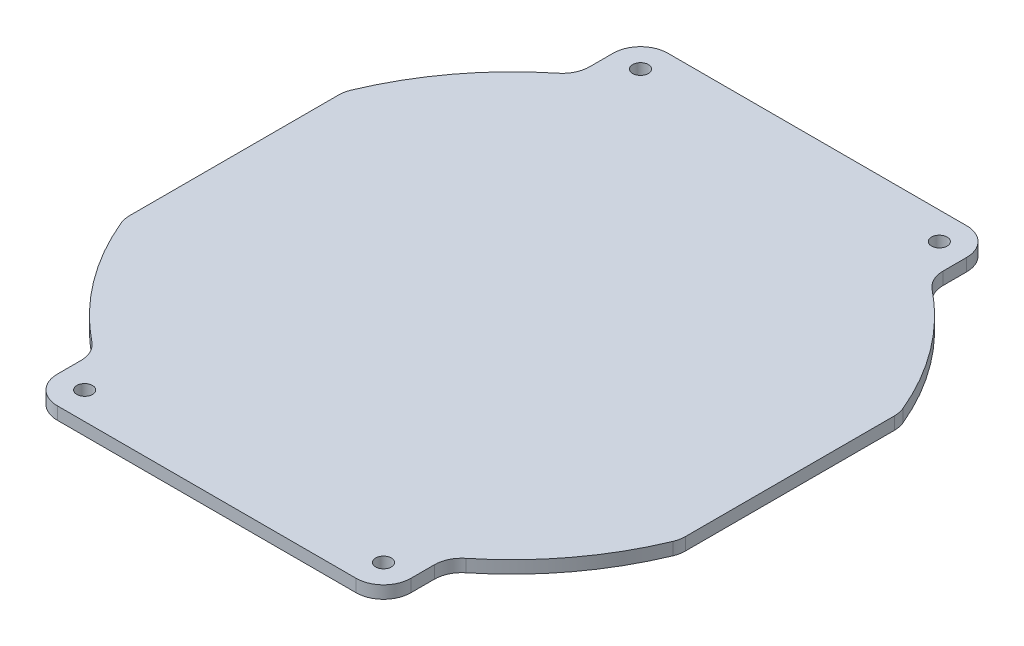
ISO-10303-21;
HEADER;
FILE_DESCRIPTION(('STEP AP214'),'2;1');
FILE_NAME('part.step','',(''),(''),'','','');
FILE_SCHEMA(('AUTOMOTIVE_DESIGN { 1 0 10303 214 1 1 1 1 }'));
ENDSEC;
DATA;
#1=APPLICATION_CONTEXT('core data for automotive mechanical design processes');
#2=APPLICATION_PROTOCOL_DEFINITION('international standard','automotive_design',2000,#1);
#3=PRODUCT_CONTEXT('',#1,'mechanical');
#4=PRODUCT('Part','Part','',(#3));
#5=PRODUCT_RELATED_PRODUCT_CATEGORY('part','',(#4));
#6=PRODUCT_DEFINITION_FORMATION('','',#4);
#7=PRODUCT_DEFINITION_CONTEXT('part definition',#1,'design');
#8=PRODUCT_DEFINITION('design','',#6,#7);
#9=PRODUCT_DEFINITION_SHAPE('','',#8);
#10=(LENGTH_UNIT() NAMED_UNIT(*) SI_UNIT(.MILLI.,.METRE.));
#11=(NAMED_UNIT(*) PLANE_ANGLE_UNIT() SI_UNIT($,.RADIAN.));
#12=(NAMED_UNIT(*) SI_UNIT($,.STERADIAN.) SOLID_ANGLE_UNIT());
#13=UNCERTAINTY_MEASURE_WITH_UNIT(LENGTH_MEASURE(1.E-05),#10,'distance_accuracy_value','');
#14=(GEOMETRIC_REPRESENTATION_CONTEXT(3) GLOBAL_UNCERTAINTY_ASSIGNED_CONTEXT((#13)) GLOBAL_UNIT_ASSIGNED_CONTEXT((#10,
#11,#12)) REPRESENTATION_CONTEXT('',''));
#15=CARTESIAN_POINT('',(0.,0.,0.));
#16=DIRECTION('',(0.,0.,1.));
#17=DIRECTION('',(1.,0.,0.));
#18=AXIS2_PLACEMENT_3D('',#15,#16,#17);
#19=CARTESIAN_POINT('',(22.5425,-19.99,10.614330550506));
#20=DIRECTION('',(-1.,0.,0.));
#21=DIRECTION('',(0.,0.,1.));
#22=AXIS2_PLACEMENT_3D('',#19,#20,#21);
#23=PLANE('',#22);
#24=DIRECTION('',(0.,0.,-1.));
#25=VECTOR('',#24,1.);
#26=CARTESIAN_POINT('',(22.5425,-21.59,10.614330550506));
#27=LINE('',#26,#25);
#28=CARTESIAN_POINT('',(22.5425,-21.59,11.2267999999997));
#29=VERTEX_POINT('',#28);
#30=CARTESIAN_POINT('',(22.5425,-21.59,8.23011963170299));
#31=VERTEX_POINT('',#30);
#32=EDGE_CURVE('E11',#29,#31,#27,.T.);
#33=ORIENTED_EDGE('',*,*,#32,.T.);
#34=DIRECTION('',(0.,1.,0.));
#35=VECTOR('',#34,1.);
#36=CARTESIAN_POINT('',(22.5425,-19.99,8.23011963170299));
#37=LINE('',#36,#35);
#38=CARTESIAN_POINT('',(22.5425,-19.99,8.23011963170299));
#39=VERTEX_POINT('',#38);
#40=EDGE_CURVE('E52',#31,#39,#37,.T.);
#41=ORIENTED_EDGE('',*,*,#40,.T.);
#42=DIRECTION('',(0.,0.,-1.));
#43=VECTOR('',#42,1.);
#44=CARTESIAN_POINT('',(22.5425,-19.99,10.614330550506));
#45=LINE('',#44,#43);
#46=CARTESIAN_POINT('',(22.5425,-19.99,11.2267999999997));
#47=VERTEX_POINT('',#46);
#48=EDGE_CURVE('E358',#47,#39,#45,.T.);
#49=ORIENTED_EDGE('',*,*,#48,.F.);
#50=DIRECTION('',(0.,-1.,0.));
#51=VECTOR('',#50,1.);
#52=CARTESIAN_POINT('',(22.5425,-19.99,11.2267999999997));
#53=LINE('',#52,#51);
#54=EDGE_CURVE('E228',#47,#29,#53,.T.);
#55=ORIENTED_EDGE('',*,*,#54,.T.);
#56=EDGE_LOOP('',(#33,#41,#49,#55));
#57=FACE_BOUND('',#56,.T.);
#58=ADVANCED_FACE('F45',(#57),#23,.F.);
#59=CARTESIAN_POINT('',(0.,-19.99,-24.2062));
#60=DIRECTION('',(0.,-1.,0.));
#61=DIRECTION('',(0.,0.,-1.));
#62=AXIS2_PLACEMENT_3D('',#59,#60,#61);
#63=CYLINDRICAL_SURFACE('',#62,38.1);
#64=CARTESIAN_POINT('',(0.,-21.59,-24.2062));
#65=DIRECTION('',(0.,1.,0.));
#66=DIRECTION('',(0.,0.,1.));
#67=AXIS2_PLACEMENT_3D('',#64,#65,#66);
#68=CIRCLE('',#67,38.1);
#69=CARTESIAN_POINT('',(23.848854961832,-21.59,5.50645920461343));
#70=VERTEX_POINT('',#69);
#71=CARTESIAN_POINT('',(35.1638532110092,-21.59,-9.53945437069972));
#72=VERTEX_POINT('',#71);
#73=EDGE_CURVE('E355',#70,#72,#68,.T.);
#74=ORIENTED_EDGE('',*,*,#73,.T.);
#75=DIRECTION('',(0.,-1.,0.));
#76=VECTOR('',#75,1.);
#77=CARTESIAN_POINT('',(35.1638532110092,-19.99,-9.53945437069972));
#78=LINE('',#77,#76);
#79=CARTESIAN_POINT('',(35.1638532110092,-19.99,-9.53945437069972));
#80=VERTEX_POINT('',#79);
#81=EDGE_CURVE('E353',#72,#80,#78,.F.);
#82=ORIENTED_EDGE('',*,*,#81,.T.);
#83=CARTESIAN_POINT('',(0.,-19.99,-24.2062));
#84=DIRECTION('',(0.,1.,0.));
#85=DIRECTION('',(0.,0.,1.));
#86=AXIS2_PLACEMENT_3D('',#83,#84,#85);
#87=CIRCLE('',#86,38.1);
#88=CARTESIAN_POINT('',(23.848854961832,-19.99,5.50645920461343));
#89=VERTEX_POINT('',#88);
#90=EDGE_CURVE('E350',#89,#80,#87,.T.);
#91=ORIENTED_EDGE('',*,*,#90,.F.);
#92=DIRECTION('',(0.,-1.,0.));
#93=VECTOR('',#92,1.);
#94=CARTESIAN_POINT('',(23.848854961832,-19.99,5.50645920461343));
#95=LINE('',#94,#93);
#96=EDGE_CURVE('E348',#89,#70,#95,.T.);
#97=ORIENTED_EDGE('',*,*,#96,.T.);
#98=EDGE_LOOP('',(#74,#82,#91,#97));
#99=FACE_BOUND('',#98,.T.);
#100=ADVANCED_FACE('F367',(#99),#63,.T.);
#101=CARTESIAN_POINT('',(35.433,-19.99,-24.2062));
#102=DIRECTION('',(-1.,0.,0.));
#103=DIRECTION('',(0.,0.,1.));
#104=AXIS2_PLACEMENT_3D('',#101,#102,#103);
#105=PLANE('',#104);
#106=DIRECTION('',(0.,0.,-1.));
#107=VECTOR('',#106,1.);
#108=CARTESIAN_POINT('',(35.433,-21.59,-24.2062));
#109=LINE('',#108,#107);
#110=CARTESIAN_POINT('',(35.433,-21.59,-10.8839060533856));
#111=VERTEX_POINT('',#110);
#112=CARTESIAN_POINT('',(35.433,-21.59,-37.5284939466144));
#113=VERTEX_POINT('',#112);
#114=EDGE_CURVE('E346',#111,#113,#109,.T.);
#115=ORIENTED_EDGE('',*,*,#114,.T.);
#116=DIRECTION('',(0.,-1.,0.));
#117=VECTOR('',#116,1.);
#118=CARTESIAN_POINT('',(35.433,-19.99,-37.5284939466144));
#119=LINE('',#118,#117);
#120=CARTESIAN_POINT('',(35.433,-19.99,-37.5284939466144));
#121=VERTEX_POINT('',#120);
#122=EDGE_CURVE('E344',#113,#121,#119,.F.);
#123=ORIENTED_EDGE('',*,*,#122,.T.);
#124=DIRECTION('',(0.,0.,-1.));
#125=VECTOR('',#124,1.);
#126=CARTESIAN_POINT('',(35.433,-19.99,-24.2062));
#127=LINE('',#126,#125);
#128=CARTESIAN_POINT('',(35.433,-19.99,-10.8839060533856));
#129=VERTEX_POINT('',#128);
#130=EDGE_CURVE('E341',#129,#121,#127,.T.);
#131=ORIENTED_EDGE('',*,*,#130,.F.);
#132=DIRECTION('',(0.,-1.,0.));
#133=VECTOR('',#132,1.);
#134=CARTESIAN_POINT('',(35.433,-19.99,-10.8839060533856));
#135=LINE('',#134,#133);
#136=EDGE_CURVE('E339',#129,#111,#135,.T.);
#137=ORIENTED_EDGE('',*,*,#136,.T.);
#138=EDGE_LOOP('',(#115,#123,#131,#137));
#139=FACE_BOUND('',#138,.T.);
#140=ADVANCED_FACE('F389',(#139),#105,.F.);
#141=CARTESIAN_POINT('',(0.,-19.99,-24.2062));
#142=DIRECTION('',(0.,-1.,0.));
#143=DIRECTION('',(0.,0.,-1.));
#144=AXIS2_PLACEMENT_3D('',#141,#142,#143);
#145=CYLINDRICAL_SURFACE('',#144,38.1);
#146=CARTESIAN_POINT('',(0.,-21.59,-24.2062));
#147=DIRECTION('',(0.,1.,0.));
#148=DIRECTION('',(0.,0.,1.));
#149=AXIS2_PLACEMENT_3D('',#146,#147,#148);
#150=CIRCLE('',#149,38.1);
#151=CARTESIAN_POINT('',(35.1638532110092,-21.59,-38.8729456293002));
#152=VERTEX_POINT('',#151);
#153=CARTESIAN_POINT('',(23.848854961832,-21.59,-53.9188592046134));
#154=VERTEX_POINT('',#153);
#155=EDGE_CURVE('E337',#152,#154,#150,.T.);
#156=ORIENTED_EDGE('',*,*,#155,.T.);
#157=DIRECTION('',(0.,-1.,0.));
#158=VECTOR('',#157,1.);
#159=CARTESIAN_POINT('',(23.848854961832,-19.99,-53.9188592046134));
#160=LINE('',#159,#158);
#161=CARTESIAN_POINT('',(23.848854961832,-19.99,-53.9188592046134));
#162=VERTEX_POINT('',#161);
#163=EDGE_CURVE('E335',#154,#162,#160,.F.);
#164=ORIENTED_EDGE('',*,*,#163,.T.);
#165=CARTESIAN_POINT('',(0.,-19.99,-24.2062));
#166=DIRECTION('',(0.,1.,0.));
#167=DIRECTION('',(0.,0.,1.));
#168=AXIS2_PLACEMENT_3D('',#165,#166,#167);
#169=CIRCLE('',#168,38.1);
#170=CARTESIAN_POINT('',(35.1638532110092,-19.99,-38.8729456293002));
#171=VERTEX_POINT('',#170);
#172=EDGE_CURVE('E332',#171,#162,#169,.T.);
#173=ORIENTED_EDGE('',*,*,#172,.F.);
#174=DIRECTION('',(0.,-1.,0.));
#175=VECTOR('',#174,1.);
#176=CARTESIAN_POINT('',(35.1638532110092,-19.99,-38.8729456293002));
#177=LINE('',#176,#175);
#178=EDGE_CURVE('E330',#171,#152,#177,.T.);
#179=ORIENTED_EDGE('',*,*,#178,.T.);
#180=EDGE_LOOP('',(#156,#164,#173,#179));
#181=FACE_BOUND('',#180,.T.);
#182=ADVANCED_FACE('F497',(#181),#145,.T.);
#183=CARTESIAN_POINT('',(22.5425,-19.99,-59.026730550506));
#184=DIRECTION('',(1.,0.,0.));
#185=DIRECTION('',(0.,0.,-1.));
#186=AXIS2_PLACEMENT_3D('',#183,#184,#185);
#187=PLANE('',#186);
#188=DIRECTION('',(0.,0.,1.));
#189=VECTOR('',#188,1.);
#190=CARTESIAN_POINT('',(22.5425,-19.99,-59.026730550506));
#191=LINE('',#190,#189);
#192=CARTESIAN_POINT('',(22.5425,-19.99,-59.6392));
#193=VERTEX_POINT('',#192);
#194=CARTESIAN_POINT('',(22.5425,-19.99,-56.642519631703));
#195=VERTEX_POINT('',#194);
#196=EDGE_CURVE('E328',#193,#195,#191,.T.);
#197=ORIENTED_EDGE('',*,*,#196,.T.);
#198=DIRECTION('',(0.,-1.,0.));
#199=VECTOR('',#198,1.);
#200=CARTESIAN_POINT('',(22.5425,-19.99,-56.642519631703));
#201=LINE('',#200,#199);
#202=CARTESIAN_POINT('',(22.5425,-21.59,-56.642519631703));
#203=VERTEX_POINT('',#202);
#204=EDGE_CURVE('E326',#195,#203,#201,.T.);
#205=ORIENTED_EDGE('',*,*,#204,.T.);
#206=DIRECTION('',(0.,0.,1.));
#207=VECTOR('',#206,1.);
#208=CARTESIAN_POINT('',(22.5425,-21.59,-59.026730550506));
#209=LINE('',#208,#207);
#210=CARTESIAN_POINT('',(22.5425,-21.59,-59.6392));
#211=VERTEX_POINT('',#210);
#212=EDGE_CURVE('E323',#211,#203,#209,.T.);
#213=ORIENTED_EDGE('',*,*,#212,.F.);
#214=DIRECTION('',(0.,-1.,0.));
#215=VECTOR('',#214,1.);
#216=CARTESIAN_POINT('',(22.5425,-19.99,-59.6392));
#217=LINE('',#216,#215);
#218=EDGE_CURVE('E321',#211,#193,#217,.F.);
#219=ORIENTED_EDGE('',*,*,#218,.T.);
#220=EDGE_LOOP('',(#197,#205,#213,#219));
#221=FACE_BOUND('',#220,.T.);
#222=ADVANCED_FACE('F487',(#221),#187,.T.);
#223=CARTESIAN_POINT('',(0.,-19.99,-63.1317));
#224=DIRECTION('',(0.,0.,-1.));
#225=DIRECTION('',(-1.,0.,0.));
#226=AXIS2_PLACEMENT_3D('',#223,#224,#225);
#227=PLANE('',#226);
#228=DIRECTION('',(1.,0.,0.));
#229=VECTOR('',#228,1.);
#230=CARTESIAN_POINT('',(0.,-19.99,-63.1317));
#231=LINE('',#230,#229);
#232=CARTESIAN_POINT('',(-19.05,-19.99,-63.1317));
#233=VERTEX_POINT('',#232);
#234=CARTESIAN_POINT('',(19.05,-19.99,-63.1317));
#235=VERTEX_POINT('',#234);
#236=EDGE_CURVE('E319',#233,#235,#231,.T.);
#237=ORIENTED_EDGE('',*,*,#236,.T.);
#238=DIRECTION('',(0.,-1.,0.));
#239=VECTOR('',#238,1.);
#240=CARTESIAN_POINT('',(19.05,-19.99,-63.1317));
#241=LINE('',#240,#239);
#242=CARTESIAN_POINT('',(19.05,-21.59,-63.1317));
#243=VERTEX_POINT('',#242);
#244=EDGE_CURVE('E317',#235,#243,#241,.T.);
#245=ORIENTED_EDGE('',*,*,#244,.T.);
#246=DIRECTION('',(1.,0.,0.));
#247=VECTOR('',#246,1.);
#248=CARTESIAN_POINT('',(0.,-21.59,-63.1317));
#249=LINE('',#248,#247);
#250=CARTESIAN_POINT('',(-19.05,-21.59,-63.1317));
#251=VERTEX_POINT('',#250);
#252=EDGE_CURVE('E314',#251,#243,#249,.T.);
#253=ORIENTED_EDGE('',*,*,#252,.F.);
#254=DIRECTION('',(0.,-1.,0.));
#255=VECTOR('',#254,1.);
#256=CARTESIAN_POINT('',(-19.05,-19.99,-63.1317));
#257=LINE('',#256,#255);
#258=EDGE_CURVE('E312',#251,#233,#257,.F.);
#259=ORIENTED_EDGE('',*,*,#258,.T.);
#260=EDGE_LOOP('',(#237,#245,#253,#259));
#261=FACE_BOUND('',#260,.T.);
#262=ADVANCED_FACE('F504',(#261),#227,.T.);
#263=CARTESIAN_POINT('',(-22.5425,-19.99,-59.026730550506));
#264=DIRECTION('',(1.,0.,0.));
#265=DIRECTION('',(0.,0.,-1.));
#266=AXIS2_PLACEMENT_3D('',#263,#264,#265);
#267=PLANE('',#266);
#268=DIRECTION('',(0.,0.,1.));
#269=VECTOR('',#268,1.);
#270=CARTESIAN_POINT('',(-22.5425,-21.59,-59.026730550506));
#271=LINE('',#270,#269);
#272=CARTESIAN_POINT('',(-22.5425,-21.59,-59.6392));
#273=VERTEX_POINT('',#272);
#274=CARTESIAN_POINT('',(-22.5425,-21.59,-56.642519631703));
#275=VERTEX_POINT('',#274);
#276=EDGE_CURVE('E310',#273,#275,#271,.T.);
#277=ORIENTED_EDGE('',*,*,#276,.T.);
#278=DIRECTION('',(0.,1.,0.));
#279=VECTOR('',#278,1.);
#280=CARTESIAN_POINT('',(-22.5425,-19.99,-56.642519631703));
#281=LINE('',#280,#279);
#282=CARTESIAN_POINT('',(-22.5425,-19.99,-56.642519631703));
#283=VERTEX_POINT('',#282);
#284=EDGE_CURVE('E308',#275,#283,#281,.T.);
#285=ORIENTED_EDGE('',*,*,#284,.T.);
#286=DIRECTION('',(0.,0.,1.));
#287=VECTOR('',#286,1.);
#288=CARTESIAN_POINT('',(-22.5425,-19.99,-59.026730550506));
#289=LINE('',#288,#287);
#290=CARTESIAN_POINT('',(-22.5425,-19.99,-59.6392));
#291=VERTEX_POINT('',#290);
#292=EDGE_CURVE('E305',#291,#283,#289,.T.);
#293=ORIENTED_EDGE('',*,*,#292,.F.);
#294=DIRECTION('',(0.,-1.,0.));
#295=VECTOR('',#294,1.);
#296=CARTESIAN_POINT('',(-22.5425,-21.59,-59.6392));
#297=LINE('',#296,#295);
#298=EDGE_CURVE('E303',#291,#273,#297,.T.);
#299=ORIENTED_EDGE('',*,*,#298,.T.);
#300=EDGE_LOOP('',(#277,#285,#293,#299));
#301=FACE_BOUND('',#300,.T.);
#302=ADVANCED_FACE('F472',(#301),#267,.F.);
#303=CARTESIAN_POINT('',(1.16226472890446E-13,-19.99,-24.2062));
#304=DIRECTION('',(0.,-1.,0.));
#305=DIRECTION('',(0.,0.,-1.));
#306=AXIS2_PLACEMENT_3D('',#303,#304,#305);
#307=CYLINDRICAL_SURFACE('',#306,38.1);
#308=CARTESIAN_POINT('',(1.16226472890446E-13,-21.59,-24.2062));
#309=DIRECTION('',(0.,1.,0.));
#310=DIRECTION('',(0.,0.,1.));
#311=AXIS2_PLACEMENT_3D('',#308,#309,#310);
#312=CIRCLE('',#311,38.1);
#313=CARTESIAN_POINT('',(-23.848854961832,-21.59,-53.9188592046134));
#314=VERTEX_POINT('',#313);
#315=CARTESIAN_POINT('',(-35.1638532110092,-21.59,-38.8729456293002));
#316=VERTEX_POINT('',#315);
#317=EDGE_CURVE('E301',#314,#316,#312,.T.);
#318=ORIENTED_EDGE('',*,*,#317,.T.);
#319=DIRECTION('',(0.,-1.,0.));
#320=VECTOR('',#319,1.);
#321=CARTESIAN_POINT('',(-35.1638532110092,-19.99,-38.8729456293002));
#322=LINE('',#321,#320);
#323=CARTESIAN_POINT('',(-35.1638532110092,-19.99,-38.8729456293002));
#324=VERTEX_POINT('',#323);
#325=EDGE_CURVE('E299',#316,#324,#322,.F.);
#326=ORIENTED_EDGE('',*,*,#325,.T.);
#327=CARTESIAN_POINT('',(1.16226472890446E-13,-19.99,-24.2062));
#328=DIRECTION('',(0.,1.,0.));
#329=DIRECTION('',(0.,0.,1.));
#330=AXIS2_PLACEMENT_3D('',#327,#328,#329);
#331=CIRCLE('',#330,38.1);
#332=CARTESIAN_POINT('',(-23.848854961832,-19.99,-53.9188592046134));
#333=VERTEX_POINT('',#332);
#334=EDGE_CURVE('E296',#333,#324,#331,.T.);
#335=ORIENTED_EDGE('',*,*,#334,.F.);
#336=DIRECTION('',(0.,-1.,0.));
#337=VECTOR('',#336,1.);
#338=CARTESIAN_POINT('',(-23.848854961832,-19.99,-53.9188592046134));
#339=LINE('',#338,#337);
#340=EDGE_CURVE('E294',#333,#314,#339,.T.);
#341=ORIENTED_EDGE('',*,*,#340,.T.);
#342=EDGE_LOOP('',(#318,#326,#335,#341));
#343=FACE_BOUND('',#342,.T.);
#344=ADVANCED_FACE('F462',(#343),#307,.T.);
#345=CARTESIAN_POINT('',(-35.433,-19.99,-24.2062));
#346=DIRECTION('',(-1.,0.,0.));
#347=DIRECTION('',(0.,0.,1.));
#348=AXIS2_PLACEMENT_3D('',#345,#346,#347);
#349=PLANE('',#348);
#350=DIRECTION('',(0.,0.,-1.));
#351=VECTOR('',#350,1.);
#352=CARTESIAN_POINT('',(-35.433,-21.59,-24.2062));
#353=LINE('',#352,#351);
#354=CARTESIAN_POINT('',(-35.433,-21.59,-10.8839060533855));
#355=VERTEX_POINT('',#354);
#356=CARTESIAN_POINT('',(-35.433,-21.59,-37.5284939466144));
#357=VERTEX_POINT('',#356);
#358=EDGE_CURVE('E291',#355,#357,#353,.T.);
#359=ORIENTED_EDGE('',*,*,#358,.F.);
#360=DIRECTION('',(0.,1.,0.));
#361=VECTOR('',#360,1.);
#362=CARTESIAN_POINT('',(-35.433,-19.99,-10.8839060533855));
#363=LINE('',#362,#361);
#364=CARTESIAN_POINT('',(-35.433,-19.99,-10.8839060533855));
#365=VERTEX_POINT('',#364);
#366=EDGE_CURVE('E289',#355,#365,#363,.T.);
#367=ORIENTED_EDGE('',*,*,#366,.T.);
#368=DIRECTION('',(0.,0.,-1.));
#369=VECTOR('',#368,1.);
#370=CARTESIAN_POINT('',(-35.433,-19.99,-24.2062));
#371=LINE('',#370,#369);
#372=CARTESIAN_POINT('',(-35.433,-19.99,-37.5284939466144));
#373=VERTEX_POINT('',#372);
#374=EDGE_CURVE('E287',#365,#373,#371,.T.);
#375=ORIENTED_EDGE('',*,*,#374,.T.);
#376=DIRECTION('',(0.,1.,0.));
#377=VECTOR('',#376,1.);
#378=CARTESIAN_POINT('',(-35.433,-21.59,-37.5284939466144));
#379=LINE('',#378,#377);
#380=EDGE_CURVE('E285',#373,#357,#379,.F.);
#381=ORIENTED_EDGE('',*,*,#380,.T.);
#382=EDGE_LOOP('',(#359,#367,#375,#381));
#383=FACE_BOUND('',#382,.T.);
#384=ADVANCED_FACE('F559',(#383),#349,.T.);
#385=CARTESIAN_POINT('',(0.,-19.99,-24.2062));
#386=DIRECTION('',(0.,-1.,0.));
#387=DIRECTION('',(0.,0.,-1.));
#388=AXIS2_PLACEMENT_3D('',#385,#386,#387);
#389=CYLINDRICAL_SURFACE('',#388,38.1);
#390=CARTESIAN_POINT('',(0.,-19.99,-24.2062));
#391=DIRECTION('',(0.,1.,0.));
#392=DIRECTION('',(0.,0.,1.));
#393=AXIS2_PLACEMENT_3D('',#390,#391,#392);
#394=CIRCLE('',#393,38.1);
#395=CARTESIAN_POINT('',(-35.1638532110092,-19.99,-9.53945437069966));
#396=VERTEX_POINT('',#395);
#397=CARTESIAN_POINT('',(-23.848854961832,-19.99,5.50645920461343));
#398=VERTEX_POINT('',#397);
#399=EDGE_CURVE('E282',#396,#398,#394,.T.);
#400=ORIENTED_EDGE('',*,*,#399,.F.);
#401=DIRECTION('',(0.,-1.,0.));
#402=VECTOR('',#401,1.);
#403=CARTESIAN_POINT('',(-35.1638532110092,-19.99,-9.53945437069966));
#404=LINE('',#403,#402);
#405=CARTESIAN_POINT('',(-35.1638532110092,-21.59,-9.53945437069966));
#406=VERTEX_POINT('',#405);
#407=EDGE_CURVE('E280',#396,#406,#404,.T.);
#408=ORIENTED_EDGE('',*,*,#407,.T.);
#409=CARTESIAN_POINT('',(0.,-21.59,-24.2062));
#410=DIRECTION('',(0.,1.,0.));
#411=DIRECTION('',(0.,0.,1.));
#412=AXIS2_PLACEMENT_3D('',#409,#410,#411);
#413=CIRCLE('',#412,38.1);
#414=CARTESIAN_POINT('',(-23.848854961832,-21.59,5.50645920461343));
#415=VERTEX_POINT('',#414);
#416=EDGE_CURVE('E278',#406,#415,#413,.T.);
#417=ORIENTED_EDGE('',*,*,#416,.T.);
#418=DIRECTION('',(0.,-1.,0.));
#419=VECTOR('',#418,1.);
#420=CARTESIAN_POINT('',(-23.848854961832,-19.99,5.50645920461343));
#421=LINE('',#420,#419);
#422=EDGE_CURVE('E276',#415,#398,#421,.F.);
#423=ORIENTED_EDGE('',*,*,#422,.T.);
#424=EDGE_LOOP('',(#400,#408,#417,#423));
#425=FACE_BOUND('',#424,.T.);
#426=ADVANCED_FACE('F447',(#425),#389,.T.);
#427=CARTESIAN_POINT('',(-22.5425,-19.99,10.614330550506));
#428=DIRECTION('',(-1.,0.,0.));
#429=DIRECTION('',(0.,0.,1.));
#430=AXIS2_PLACEMENT_3D('',#427,#428,#429);
#431=PLANE('',#430);
#432=DIRECTION('',(0.,0.,-1.));
#433=VECTOR('',#432,1.);
#434=CARTESIAN_POINT('',(-22.5425,-19.99,10.614330550506));
#435=LINE('',#434,#433);
#436=CARTESIAN_POINT('',(-22.5425,-19.99,11.2267999999997));
#437=VERTEX_POINT('',#436);
#438=CARTESIAN_POINT('',(-22.5425,-19.99,8.230119631703));
#439=VERTEX_POINT('',#438);
#440=EDGE_CURVE('E274',#437,#439,#435,.T.);
#441=ORIENTED_EDGE('',*,*,#440,.T.);
#442=DIRECTION('',(0.,-1.,0.));
#443=VECTOR('',#442,1.);
#444=CARTESIAN_POINT('',(-22.5425,-19.99,8.230119631703));
#445=LINE('',#444,#443);
#446=CARTESIAN_POINT('',(-22.5425,-21.59,8.230119631703));
#447=VERTEX_POINT('',#446);
#448=EDGE_CURVE('E272',#439,#447,#445,.T.);
#449=ORIENTED_EDGE('',*,*,#448,.T.);
#450=DIRECTION('',(0.,0.,-1.));
#451=VECTOR('',#450,1.);
#452=CARTESIAN_POINT('',(-22.5425,-21.59,10.614330550506));
#453=LINE('',#452,#451);
#454=CARTESIAN_POINT('',(-22.5425,-21.59,11.2267999999997));
#455=VERTEX_POINT('',#454);
#456=EDGE_CURVE('E269',#455,#447,#453,.T.);
#457=ORIENTED_EDGE('',*,*,#456,.F.);
#458=DIRECTION('',(0.,-1.,0.));
#459=VECTOR('',#458,1.);
#460=CARTESIAN_POINT('',(-22.5425,-19.99,11.2267999999997));
#461=LINE('',#460,#459);
#462=EDGE_CURVE('E267',#455,#437,#461,.F.);
#463=ORIENTED_EDGE('',*,*,#462,.T.);
#464=EDGE_LOOP('',(#441,#449,#457,#463));
#465=FACE_BOUND('',#464,.T.);
#466=ADVANCED_FACE('F578',(#465),#431,.T.);
#467=CARTESIAN_POINT('',(-19.05,-19.99,11.2268));
#468=DIRECTION('',(0.,-1.,0.));
#469=DIRECTION('',(0.,0.,-1.));
#470=AXIS2_PLACEMENT_3D('',#467,#468,#469);
#471=CYLINDRICAL_SURFACE('',#470,1.);
#472=CARTESIAN_POINT('',(-19.05,-19.99,11.2268));
#473=DIRECTION('',(0.,1.,0.));
#474=DIRECTION('',(0.,0.,1.));
#475=AXIS2_PLACEMENT_3D('',#472,#473,#474);
#476=CIRCLE('',#475,1.);
#477=CARTESIAN_POINT('',(-19.05,-19.99,12.2268));
#478=VERTEX_POINT('',#477);
#479=EDGE_CURVE('E264',#478,#478,#476,.T.);
#480=ORIENTED_EDGE('',*,*,#479,.T.);
#481=EDGE_LOOP('',(#480));
#482=FACE_BOUND('',#481,.T.);
#483=CARTESIAN_POINT('',(-19.05,-21.59,11.2268));
#484=DIRECTION('',(0.,1.,0.));
#485=DIRECTION('',(0.,0.,1.));
#486=AXIS2_PLACEMENT_3D('',#483,#484,#485);
#487=CIRCLE('',#486,1.);
#488=CARTESIAN_POINT('',(-19.05,-21.59,12.2268));
#489=VERTEX_POINT('',#488);
#490=EDGE_CURVE('E261',#489,#489,#487,.T.);
#491=ORIENTED_EDGE('',*,*,#490,.F.);
#492=EDGE_LOOP('',(#491));
#493=FACE_BOUND('',#492,.T.);
#494=ADVANCED_FACE('F588',(#482,#493),#471,.F.);
#495=CARTESIAN_POINT('',(19.05,-19.99,-59.6392));
#496=DIRECTION('',(0.,-1.,0.));
#497=DIRECTION('',(0.,0.,-1.));
#498=AXIS2_PLACEMENT_3D('',#495,#496,#497);
#499=CYLINDRICAL_SURFACE('',#498,1.);
#500=CARTESIAN_POINT('',(19.05,-19.99,-59.6392));
#501=DIRECTION('',(0.,1.,0.));
#502=DIRECTION('',(0.,0.,1.));
#503=AXIS2_PLACEMENT_3D('',#500,#501,#502);
#504=CIRCLE('',#503,1.);
#505=CARTESIAN_POINT('',(19.05,-19.99,-58.6392));
#506=VERTEX_POINT('',#505);
#507=EDGE_CURVE('E258',#506,#506,#504,.T.);
#508=ORIENTED_EDGE('',*,*,#507,.T.);
#509=EDGE_LOOP('',(#508));
#510=FACE_BOUND('',#509,.T.);
#511=CARTESIAN_POINT('',(19.05,-21.59,-59.6392));
#512=DIRECTION('',(0.,1.,0.));
#513=DIRECTION('',(0.,0.,1.));
#514=AXIS2_PLACEMENT_3D('',#511,#512,#513);
#515=CIRCLE('',#514,1.);
#516=CARTESIAN_POINT('',(19.05,-21.59,-58.6392));
#517=VERTEX_POINT('',#516);
#518=EDGE_CURVE('E255',#517,#517,#515,.T.);
#519=ORIENTED_EDGE('',*,*,#518,.F.);
#520=EDGE_LOOP('',(#519));
#521=FACE_BOUND('',#520,.T.);
#522=ADVANCED_FACE('F599',(#510,#521),#499,.F.);
#523=CARTESIAN_POINT('',(-19.05,-19.99,-59.6392));
#524=DIRECTION('',(0.,-1.,0.));
#525=DIRECTION('',(0.,0.,-1.));
#526=AXIS2_PLACEMENT_3D('',#523,#524,#525);
#527=CYLINDRICAL_SURFACE('',#526,1.);
#528=CARTESIAN_POINT('',(-19.05,-19.99,-59.6392));
#529=DIRECTION('',(0.,1.,0.));
#530=DIRECTION('',(0.,0.,1.));
#531=AXIS2_PLACEMENT_3D('',#528,#529,#530);
#532=CIRCLE('',#531,1.);
#533=CARTESIAN_POINT('',(-19.05,-19.99,-58.6392));
#534=VERTEX_POINT('',#533);
#535=EDGE_CURVE('E252',#534,#534,#532,.T.);
#536=ORIENTED_EDGE('',*,*,#535,.T.);
#537=EDGE_LOOP('',(#536));
#538=FACE_BOUND('',#537,.T.);
#539=CARTESIAN_POINT('',(-19.05,-21.59,-59.6392));
#540=DIRECTION('',(0.,1.,0.));
#541=DIRECTION('',(0.,0.,1.));
#542=AXIS2_PLACEMENT_3D('',#539,#540,#541);
#543=CIRCLE('',#542,1.);
#544=CARTESIAN_POINT('',(-19.05,-21.59,-58.6392));
#545=VERTEX_POINT('',#544);
#546=EDGE_CURVE('E224',#545,#545,#543,.T.);
#547=ORIENTED_EDGE('',*,*,#546,.F.);
#548=EDGE_LOOP('',(#547));
#549=FACE_BOUND('',#548,.T.);
#550=ADVANCED_FACE('F610',(#538,#549),#527,.F.);
#551=CARTESIAN_POINT('',(0.,-19.99,14.7192999999997));
#552=DIRECTION('',(0.,0.,-1.));
#553=DIRECTION('',(-1.,0.,0.));
#554=AXIS2_PLACEMENT_3D('',#551,#552,#553);
#555=PLANE('',#554);
#556=DIRECTION('',(1.,0.,0.));
#557=VECTOR('',#556,1.);
#558=CARTESIAN_POINT('',(0.,-19.99,14.7192999999997));
#559=LINE('',#558,#557);
#560=CARTESIAN_POINT('',(-19.05,-19.99,14.7192999999997));
#561=VERTEX_POINT('',#560);
#562=CARTESIAN_POINT('',(19.05,-19.99,14.7192999999997));
#563=VERTEX_POINT('',#562);
#564=EDGE_CURVE('E203',#561,#563,#559,.T.);
#565=ORIENTED_EDGE('',*,*,#564,.F.);
#566=DIRECTION('',(0.,-1.,0.));
#567=VECTOR('',#566,1.);
#568=CARTESIAN_POINT('',(-19.05,-21.59,14.7192999999997));
#569=LINE('',#568,#567);
#570=CARTESIAN_POINT('',(-19.05,-21.59,14.7192999999997));
#571=VERTEX_POINT('',#570);
#572=EDGE_CURVE('E225',#561,#571,#569,.T.);
#573=ORIENTED_EDGE('',*,*,#572,.T.);
#574=DIRECTION('',(1.,0.,0.));
#575=VECTOR('',#574,1.);
#576=CARTESIAN_POINT('',(0.,-21.59,14.7192999999997));
#577=LINE('',#576,#575);
#578=CARTESIAN_POINT('',(19.05,-21.59,14.7192999999997));
#579=VERTEX_POINT('',#578);
#580=EDGE_CURVE('E206',#571,#579,#577,.T.);
#581=ORIENTED_EDGE('',*,*,#580,.T.);
#582=DIRECTION('',(0.,-1.,0.));
#583=VECTOR('',#582,1.);
#584=CARTESIAN_POINT('',(19.05,-19.99,14.7192999999997));
#585=LINE('',#584,#583);
#586=EDGE_CURVE('E200',#579,#563,#585,.F.);
#587=ORIENTED_EDGE('',*,*,#586,.T.);
#588=EDGE_LOOP('',(#565,#573,#581,#587));
#589=FACE_BOUND('',#588,.T.);
#590=ADVANCED_FACE('F202',(#589),#555,.F.);
#591=CARTESIAN_POINT('',(19.05,-19.99,11.2268));
#592=DIRECTION('',(0.,-1.,0.));
#593=DIRECTION('',(0.,0.,-1.));
#594=AXIS2_PLACEMENT_3D('',#591,#592,#593);
#595=CYLINDRICAL_SURFACE('',#594,1.);
#596=CARTESIAN_POINT('',(19.05,-19.99,11.2268));
#597=DIRECTION('',(0.,1.,0.));
#598=DIRECTION('',(0.,0.,1.));
#599=AXIS2_PLACEMENT_3D('',#596,#597,#598);
#600=CIRCLE('',#599,1.);
#601=CARTESIAN_POINT('',(19.05,-19.99,12.2268));
#602=VERTEX_POINT('',#601);
#603=EDGE_CURVE('E211',#602,#602,#600,.T.);
#604=ORIENTED_EDGE('',*,*,#603,.T.);
#605=EDGE_LOOP('',(#604));
#606=FACE_BOUND('',#605,.T.);
#607=CARTESIAN_POINT('',(19.05,-21.59,11.2268));
#608=DIRECTION('',(0.,1.,0.));
#609=DIRECTION('',(0.,0.,1.));
#610=AXIS2_PLACEMENT_3D('',#607,#608,#609);
#611=CIRCLE('',#610,1.);
#612=CARTESIAN_POINT('',(19.05,-21.59,12.2268));
#613=VERTEX_POINT('',#612);
#614=EDGE_CURVE('E243',#613,#613,#611,.T.);
#615=ORIENTED_EDGE('',*,*,#614,.F.);
#616=EDGE_LOOP('',(#615));
#617=FACE_BOUND('',#616,.T.);
#618=ADVANCED_FACE('F631',(#606,#617),#595,.F.);
#619=CARTESIAN_POINT('',(-1.33349999999999,-19.99,-24.2062));
#620=DIRECTION('',(0.,1.,0.));
#621=DIRECTION('',(-1.,0.,0.));
#622=AXIS2_PLACEMENT_3D('',#619,#620,#621);
#623=PLANE('',#622);
#624=ORIENTED_EDGE('',*,*,#374,.F.);
#625=CARTESIAN_POINT('',(-31.9405,-19.99,-10.8839060533855));
#626=DIRECTION('',(0.,1.,0.));
#627=DIRECTION('',(0.,0.,1.));
#628=AXIS2_PLACEMENT_3D('',#625,#626,#627);
#629=CIRCLE('',#628,3.4925);
#630=EDGE_CURVE('E240',#365,#396,#629,.T.);
#631=ORIENTED_EDGE('',*,*,#630,.T.);
#632=ORIENTED_EDGE('',*,*,#399,.T.);
#633=CARTESIAN_POINT('',(-26.035,-19.99,8.230119631703));
#634=DIRECTION('',(0.,1.,0.));
#635=DIRECTION('',(0.,0.,1.));
#636=AXIS2_PLACEMENT_3D('',#633,#634,#635);
#637=CIRCLE('',#636,3.4925);
#638=EDGE_CURVE('E231',#398,#439,#637,.F.);
#639=ORIENTED_EDGE('',*,*,#638,.T.);
#640=ORIENTED_EDGE('',*,*,#440,.F.);
#641=CARTESIAN_POINT('',(-19.05,-19.99,11.2267999999997));
#642=DIRECTION('',(0.,1.,0.));
#643=DIRECTION('',(0.,0.,1.));
#644=AXIS2_PLACEMENT_3D('',#641,#642,#643);
#645=CIRCLE('',#644,3.4925);
#646=EDGE_CURVE('E222',#437,#561,#645,.T.);
#647=ORIENTED_EDGE('',*,*,#646,.T.);
#648=ORIENTED_EDGE('',*,*,#564,.T.);
#649=CARTESIAN_POINT('',(19.05,-19.99,11.2267999999997));
#650=DIRECTION('',(0.,1.,0.));
#651=DIRECTION('',(0.,0.,1.));
#652=AXIS2_PLACEMENT_3D('',#649,#650,#651);
#653=CIRCLE('',#652,3.4925);
#654=EDGE_CURVE('E218',#563,#47,#653,.T.);
#655=ORIENTED_EDGE('',*,*,#654,.T.);
#656=ORIENTED_EDGE('',*,*,#48,.T.);
#657=CARTESIAN_POINT('',(26.035,-19.99,8.23011963170299));
#658=DIRECTION('',(0.,1.,0.));
#659=DIRECTION('',(0.,0.,1.));
#660=AXIS2_PLACEMENT_3D('',#657,#658,#659);
#661=CIRCLE('',#660,3.4925);
#662=EDGE_CURVE('E229',#39,#89,#661,.F.);
#663=ORIENTED_EDGE('',*,*,#662,.T.);
#664=ORIENTED_EDGE('',*,*,#90,.T.);
#665=CARTESIAN_POINT('',(31.9405,-19.99,-10.8839060533856));
#666=DIRECTION('',(0.,1.,0.));
#667=DIRECTION('',(0.,0.,1.));
#668=AXIS2_PLACEMENT_3D('',#665,#666,#667);
#669=CIRCLE('',#668,3.4925);
#670=EDGE_CURVE('E234',#80,#129,#669,.T.);
#671=ORIENTED_EDGE('',*,*,#670,.T.);
#672=ORIENTED_EDGE('',*,*,#130,.T.);
#673=CARTESIAN_POINT('',(31.9405,-19.99,-37.5284939466144));
#674=DIRECTION('',(0.,1.,0.));
#675=DIRECTION('',(0.,0.,1.));
#676=AXIS2_PLACEMENT_3D('',#673,#674,#675);
#677=CIRCLE('',#676,3.4925);
#678=EDGE_CURVE('E387',#121,#171,#677,.T.);
#679=ORIENTED_EDGE('',*,*,#678,.T.);
#680=ORIENTED_EDGE('',*,*,#172,.T.);
#681=CARTESIAN_POINT('',(26.035,-19.99,-56.642519631703));
#682=DIRECTION('',(0.,1.,0.));
#683=DIRECTION('',(0.,0.,1.));
#684=AXIS2_PLACEMENT_3D('',#681,#682,#683);
#685=CIRCLE('',#684,3.4925);
#686=EDGE_CURVE('E395',#162,#195,#685,.F.);
#687=ORIENTED_EDGE('',*,*,#686,.T.);
#688=ORIENTED_EDGE('',*,*,#196,.F.);
#689=CARTESIAN_POINT('',(19.05,-19.99,-59.6392));
#690=DIRECTION('',(0.,1.,0.));
#691=DIRECTION('',(0.,0.,1.));
#692=AXIS2_PLACEMENT_3D('',#689,#690,#691);
#693=CIRCLE('',#692,3.4925);
#694=EDGE_CURVE('E398',#193,#235,#693,.T.);
#695=ORIENTED_EDGE('',*,*,#694,.T.);
#696=ORIENTED_EDGE('',*,*,#236,.F.);
#697=CARTESIAN_POINT('',(-19.05,-19.99,-59.6392));
#698=DIRECTION('',(0.,1.,0.));
#699=DIRECTION('',(0.,0.,1.));
#700=AXIS2_PLACEMENT_3D('',#697,#698,#699);
#701=CIRCLE('',#700,3.4925);
#702=EDGE_CURVE('E403',#233,#291,#701,.T.);
#703=ORIENTED_EDGE('',*,*,#702,.T.);
#704=ORIENTED_EDGE('',*,*,#292,.T.);
#705=CARTESIAN_POINT('',(-26.035,-19.99,-56.642519631703));
#706=DIRECTION('',(0.,1.,0.));
#707=DIRECTION('',(0.,0.,1.));
#708=AXIS2_PLACEMENT_3D('',#705,#706,#707);
#709=CIRCLE('',#708,3.4925);
#710=EDGE_CURVE('E406',#283,#333,#709,.F.);
#711=ORIENTED_EDGE('',*,*,#710,.T.);
#712=ORIENTED_EDGE('',*,*,#334,.T.);
#713=CARTESIAN_POINT('',(-31.9405,-19.99,-37.5284939466144));
#714=DIRECTION('',(0.,1.,0.));
#715=DIRECTION('',(0.,0.,1.));
#716=AXIS2_PLACEMENT_3D('',#713,#714,#715);
#717=CIRCLE('',#716,3.4925);
#718=EDGE_CURVE('E409',#324,#373,#717,.T.);
#719=ORIENTED_EDGE('',*,*,#718,.T.);
#720=EDGE_LOOP('',(#624,#631,#632,#639,#640,#647,#648,#655,#656,#663,#664,#671,#672,#679,#680,
#687,#688,#695,#696,#703,#704,#711,#712,#719));
#721=FACE_BOUND('',#720,.T.);
#722=ORIENTED_EDGE('',*,*,#535,.F.);
#723=EDGE_LOOP('',(#722));
#724=FACE_BOUND('',#723,.T.);
#725=ORIENTED_EDGE('',*,*,#507,.F.);
#726=EDGE_LOOP('',(#725));
#727=FACE_BOUND('',#726,.T.);
#728=ORIENTED_EDGE('',*,*,#479,.F.);
#729=EDGE_LOOP('',(#728));
#730=FACE_BOUND('',#729,.T.);
#731=ORIENTED_EDGE('',*,*,#603,.F.);
#732=EDGE_LOOP('',(#731));
#733=FACE_BOUND('',#732,.T.);
#734=ADVANCED_FACE('F216',(#721,#724,#727,#730,#733),#623,.T.);
#735=CARTESIAN_POINT('',(-1.33349999999999,-21.59,-24.2062));
#736=DIRECTION('',(0.,1.,0.));
#737=DIRECTION('',(-1.,0.,0.));
#738=AXIS2_PLACEMENT_3D('',#735,#736,#737);
#739=PLANE('',#738);
#740=ORIENTED_EDGE('',*,*,#416,.F.);
#741=CARTESIAN_POINT('',(-31.9405,-21.59,-10.8839060533855));
#742=DIRECTION('',(0.,1.,0.));
#743=DIRECTION('',(0.,0.,1.));
#744=AXIS2_PLACEMENT_3D('',#741,#742,#743);
#745=CIRCLE('',#744,3.4925);
#746=EDGE_CURVE('E412',#406,#355,#745,.F.);
#747=ORIENTED_EDGE('',*,*,#746,.T.);
#748=ORIENTED_EDGE('',*,*,#358,.T.);
#749=CARTESIAN_POINT('',(-31.9405,-21.59,-37.5284939466144));
#750=DIRECTION('',(0.,1.,0.));
#751=DIRECTION('',(0.,0.,1.));
#752=AXIS2_PLACEMENT_3D('',#749,#750,#751);
#753=CIRCLE('',#752,3.4925);
#754=EDGE_CURVE('E415',#357,#316,#753,.F.);
#755=ORIENTED_EDGE('',*,*,#754,.T.);
#756=ORIENTED_EDGE('',*,*,#317,.F.);
#757=CARTESIAN_POINT('',(-26.035,-21.59,-56.642519631703));
#758=DIRECTION('',(0.,1.,0.));
#759=DIRECTION('',(0.,0.,1.));
#760=AXIS2_PLACEMENT_3D('',#757,#758,#759);
#761=CIRCLE('',#760,3.4925);
#762=EDGE_CURVE('E418',#314,#275,#761,.T.);
#763=ORIENTED_EDGE('',*,*,#762,.T.);
#764=ORIENTED_EDGE('',*,*,#276,.F.);
#765=CARTESIAN_POINT('',(-19.05,-21.59,-59.6392));
#766=DIRECTION('',(0.,1.,0.));
#767=DIRECTION('',(0.,0.,1.));
#768=AXIS2_PLACEMENT_3D('',#765,#766,#767);
#769=CIRCLE('',#768,3.4925);
#770=EDGE_CURVE('E421',#273,#251,#769,.F.);
#771=ORIENTED_EDGE('',*,*,#770,.T.);
#772=ORIENTED_EDGE('',*,*,#252,.T.);
#773=CARTESIAN_POINT('',(19.05,-21.59,-59.6392));
#774=DIRECTION('',(0.,1.,0.));
#775=DIRECTION('',(0.,0.,1.));
#776=AXIS2_PLACEMENT_3D('',#773,#774,#775);
#777=CIRCLE('',#776,3.4925);
#778=EDGE_CURVE('E424',#243,#211,#777,.F.);
#779=ORIENTED_EDGE('',*,*,#778,.T.);
#780=ORIENTED_EDGE('',*,*,#212,.T.);
#781=CARTESIAN_POINT('',(26.035,-21.59,-56.642519631703));
#782=DIRECTION('',(0.,1.,0.));
#783=DIRECTION('',(0.,0.,1.));
#784=AXIS2_PLACEMENT_3D('',#781,#782,#783);
#785=CIRCLE('',#784,3.4925);
#786=EDGE_CURVE('E427',#203,#154,#785,.T.);
#787=ORIENTED_EDGE('',*,*,#786,.T.);
#788=ORIENTED_EDGE('',*,*,#155,.F.);
#789=CARTESIAN_POINT('',(31.9405,-21.59,-37.5284939466144));
#790=DIRECTION('',(0.,1.,0.));
#791=DIRECTION('',(0.,0.,1.));
#792=AXIS2_PLACEMENT_3D('',#789,#790,#791);
#793=CIRCLE('',#792,3.4925);
#794=EDGE_CURVE('E380',#152,#113,#793,.F.);
#795=ORIENTED_EDGE('',*,*,#794,.T.);
#796=ORIENTED_EDGE('',*,*,#114,.F.);
#797=CARTESIAN_POINT('',(31.9405,-21.59,-10.8839060533856));
#798=DIRECTION('',(0.,1.,0.));
#799=DIRECTION('',(0.,0.,1.));
#800=AXIS2_PLACEMENT_3D('',#797,#798,#799);
#801=CIRCLE('',#800,3.4925);
#802=EDGE_CURVE('E375',#111,#72,#801,.F.);
#803=ORIENTED_EDGE('',*,*,#802,.T.);
#804=ORIENTED_EDGE('',*,*,#73,.F.);
#805=CARTESIAN_POINT('',(26.035,-21.59,8.23011963170299));
#806=DIRECTION('',(0.,1.,0.));
#807=DIRECTION('',(0.,0.,1.));
#808=AXIS2_PLACEMENT_3D('',#805,#806,#807);
#809=CIRCLE('',#808,3.4925);
#810=EDGE_CURVE('E364',#70,#31,#809,.T.);
#811=ORIENTED_EDGE('',*,*,#810,.T.);
#812=ORIENTED_EDGE('',*,*,#32,.F.);
#813=CARTESIAN_POINT('',(19.05,-21.59,11.2267999999997));
#814=DIRECTION('',(0.,1.,0.));
#815=DIRECTION('',(0.,0.,1.));
#816=AXIS2_PLACEMENT_3D('',#813,#814,#815);
#817=CIRCLE('',#816,3.4925);
#818=EDGE_CURVE('E432',#29,#579,#817,.F.);
#819=ORIENTED_EDGE('',*,*,#818,.T.);
#820=ORIENTED_EDGE('',*,*,#580,.F.);
#821=CARTESIAN_POINT('',(-19.05,-21.59,11.2267999999997));
#822=DIRECTION('',(0.,1.,0.));
#823=DIRECTION('',(0.,0.,1.));
#824=AXIS2_PLACEMENT_3D('',#821,#822,#823);
#825=CIRCLE('',#824,3.4925);
#826=EDGE_CURVE('E434',#571,#455,#825,.F.);
#827=ORIENTED_EDGE('',*,*,#826,.T.);
#828=ORIENTED_EDGE('',*,*,#456,.T.);
#829=CARTESIAN_POINT('',(-26.035,-21.59,8.230119631703));
#830=DIRECTION('',(0.,1.,0.));
#831=DIRECTION('',(0.,0.,1.));
#832=AXIS2_PLACEMENT_3D('',#829,#830,#831);
#833=CIRCLE('',#832,3.4925);
#834=EDGE_CURVE('E437',#447,#415,#833,.T.);
#835=ORIENTED_EDGE('',*,*,#834,.T.);
#836=EDGE_LOOP('',(#740,#747,#748,#755,#756,#763,#764,#771,#772,#779,#780,#787,#788,#795,#796,
#803,#804,#811,#812,#819,#820,#827,#828,#835));
#837=FACE_BOUND('',#836,.T.);
#838=ORIENTED_EDGE('',*,*,#546,.T.);
#839=EDGE_LOOP('',(#838));
#840=FACE_BOUND('',#839,.T.);
#841=ORIENTED_EDGE('',*,*,#518,.T.);
#842=EDGE_LOOP('',(#841));
#843=FACE_BOUND('',#842,.T.);
#844=ORIENTED_EDGE('',*,*,#490,.T.);
#845=EDGE_LOOP('',(#844));
#846=FACE_BOUND('',#845,.T.);
#847=ORIENTED_EDGE('',*,*,#614,.T.);
#848=EDGE_LOOP('',(#847));
#849=FACE_BOUND('',#848,.T.);
#850=ADVANCED_FACE('F371',(#837,#840,#843,#846,#849),#739,.F.);
#851=CARTESIAN_POINT('',(-31.9405,-19.99,-10.8839060533855));
#852=DIRECTION('',(0.,-1.,0.));
#853=DIRECTION('',(0.,0.,-1.));
#854=AXIS2_PLACEMENT_3D('',#851,#852,#853);
#855=CYLINDRICAL_SURFACE('',#854,3.4925);
#856=ORIENTED_EDGE('',*,*,#630,.F.);
#857=ORIENTED_EDGE('',*,*,#366,.F.);
#858=ORIENTED_EDGE('',*,*,#746,.F.);
#859=ORIENTED_EDGE('',*,*,#407,.F.);
#860=EDGE_LOOP('',(#856,#857,#858,#859));
#861=FACE_BOUND('',#860,.T.);
#862=ADVANCED_FACE('F452',(#861),#855,.T.);
#863=CARTESIAN_POINT('',(-31.9405,-19.99,-37.5284939466144));
#864=DIRECTION('',(0.,-1.,0.));
#865=DIRECTION('',(0.,0.,-1.));
#866=AXIS2_PLACEMENT_3D('',#863,#864,#865);
#867=CYLINDRICAL_SURFACE('',#866,3.4925);
#868=ORIENTED_EDGE('',*,*,#718,.F.);
#869=ORIENTED_EDGE('',*,*,#325,.F.);
#870=ORIENTED_EDGE('',*,*,#754,.F.);
#871=ORIENTED_EDGE('',*,*,#380,.F.);
#872=EDGE_LOOP('',(#868,#869,#870,#871));
#873=FACE_BOUND('',#872,.T.);
#874=ADVANCED_FACE('F460',(#873),#867,.T.);
#875=CARTESIAN_POINT('',(-26.035,-19.99,-56.642519631703));
#876=DIRECTION('',(0.,-1.,0.));
#877=DIRECTION('',(0.,0.,-1.));
#878=AXIS2_PLACEMENT_3D('',#875,#876,#877);
#879=CYLINDRICAL_SURFACE('',#878,3.4925);
#880=ORIENTED_EDGE('',*,*,#710,.F.);
#881=ORIENTED_EDGE('',*,*,#284,.F.);
#882=ORIENTED_EDGE('',*,*,#762,.F.);
#883=ORIENTED_EDGE('',*,*,#340,.F.);
#884=EDGE_LOOP('',(#880,#881,#882,#883));
#885=FACE_BOUND('',#884,.T.);
#886=ADVANCED_FACE('F468',(#885),#879,.F.);
#887=CARTESIAN_POINT('',(26.035,-19.99,-56.642519631703));
#888=DIRECTION('',(0.,-1.,0.));
#889=DIRECTION('',(0.,0.,-1.));
#890=AXIS2_PLACEMENT_3D('',#887,#888,#889);
#891=CYLINDRICAL_SURFACE('',#890,3.4925);
#892=ORIENTED_EDGE('',*,*,#686,.F.);
#893=ORIENTED_EDGE('',*,*,#163,.F.);
#894=ORIENTED_EDGE('',*,*,#786,.F.);
#895=ORIENTED_EDGE('',*,*,#204,.F.);
#896=EDGE_LOOP('',(#892,#893,#894,#895));
#897=FACE_BOUND('',#896,.T.);
#898=ADVANCED_FACE('F494',(#897),#891,.F.);
#899=CARTESIAN_POINT('',(31.9405,-19.99,-37.5284939466144));
#900=DIRECTION('',(0.,-1.,0.));
#901=DIRECTION('',(0.,0.,-1.));
#902=AXIS2_PLACEMENT_3D('',#899,#900,#901);
#903=CYLINDRICAL_SURFACE('',#902,3.4925);
#904=ORIENTED_EDGE('',*,*,#678,.F.);
#905=ORIENTED_EDGE('',*,*,#122,.F.);
#906=ORIENTED_EDGE('',*,*,#794,.F.);
#907=ORIENTED_EDGE('',*,*,#178,.F.);
#908=EDGE_LOOP('',(#904,#905,#906,#907));
#909=FACE_BOUND('',#908,.T.);
#910=ADVANCED_FACE('F393',(#909),#903,.T.);
#911=CARTESIAN_POINT('',(31.9405,-19.99,-10.8839060533856));
#912=DIRECTION('',(0.,-1.,0.));
#913=DIRECTION('',(0.,0.,-1.));
#914=AXIS2_PLACEMENT_3D('',#911,#912,#913);
#915=CYLINDRICAL_SURFACE('',#914,3.4925);
#916=ORIENTED_EDGE('',*,*,#670,.F.);
#917=ORIENTED_EDGE('',*,*,#81,.F.);
#918=ORIENTED_EDGE('',*,*,#802,.F.);
#919=ORIENTED_EDGE('',*,*,#136,.F.);
#920=EDGE_LOOP('',(#916,#917,#918,#919));
#921=FACE_BOUND('',#920,.T.);
#922=ADVANCED_FACE('F383',(#921),#915,.T.);
#923=CARTESIAN_POINT('',(26.035,-19.99,8.23011963170299));
#924=DIRECTION('',(0.,-1.,0.));
#925=DIRECTION('',(0.,0.,-1.));
#926=AXIS2_PLACEMENT_3D('',#923,#924,#925);
#927=CYLINDRICAL_SURFACE('',#926,3.4925);
#928=ORIENTED_EDGE('',*,*,#662,.F.);
#929=ORIENTED_EDGE('',*,*,#40,.F.);
#930=ORIENTED_EDGE('',*,*,#810,.F.);
#931=ORIENTED_EDGE('',*,*,#96,.F.);
#932=EDGE_LOOP('',(#928,#929,#930,#931));
#933=FACE_BOUND('',#932,.T.);
#934=ADVANCED_FACE('F362',(#933),#927,.F.);
#935=CARTESIAN_POINT('',(-26.035,-19.99,8.230119631703));
#936=DIRECTION('',(0.,-1.,0.));
#937=DIRECTION('',(0.,0.,-1.));
#938=AXIS2_PLACEMENT_3D('',#935,#936,#937);
#939=CYLINDRICAL_SURFACE('',#938,3.4925);
#940=ORIENTED_EDGE('',*,*,#638,.F.);
#941=ORIENTED_EDGE('',*,*,#422,.F.);
#942=ORIENTED_EDGE('',*,*,#834,.F.);
#943=ORIENTED_EDGE('',*,*,#448,.F.);
#944=EDGE_LOOP('',(#940,#941,#942,#943));
#945=FACE_BOUND('',#944,.T.);
#946=ADVANCED_FACE('F445',(#945),#939,.F.);
#947=CARTESIAN_POINT('',(19.05,-19.99,-59.6392));
#948=DIRECTION('',(0.,-1.,0.));
#949=DIRECTION('',(0.,0.,-1.));
#950=AXIS2_PLACEMENT_3D('',#947,#948,#949);
#951=CYLINDRICAL_SURFACE('',#950,3.4925);
#952=ORIENTED_EDGE('',*,*,#694,.F.);
#953=ORIENTED_EDGE('',*,*,#218,.F.);
#954=ORIENTED_EDGE('',*,*,#778,.F.);
#955=ORIENTED_EDGE('',*,*,#244,.F.);
#956=EDGE_LOOP('',(#952,#953,#954,#955));
#957=FACE_BOUND('',#956,.T.);
#958=ADVANCED_FACE('F484',(#957),#951,.T.);
#959=CARTESIAN_POINT('',(-19.05,-19.99,-59.6392));
#960=DIRECTION('',(0.,1.,0.));
#961=DIRECTION('',(0.,0.,1.));
#962=AXIS2_PLACEMENT_3D('',#959,#960,#961);
#963=CYLINDRICAL_SURFACE('',#962,3.4925);
#964=ORIENTED_EDGE('',*,*,#702,.F.);
#965=ORIENTED_EDGE('',*,*,#258,.F.);
#966=ORIENTED_EDGE('',*,*,#770,.F.);
#967=ORIENTED_EDGE('',*,*,#298,.F.);
#968=EDGE_LOOP('',(#964,#965,#966,#967));
#969=FACE_BOUND('',#968,.T.);
#970=ADVANCED_FACE('F476',(#969),#963,.T.);
#971=CARTESIAN_POINT('',(-19.05,-19.99,11.2267999999997));
#972=DIRECTION('',(0.,1.,0.));
#973=DIRECTION('',(0.,0.,1.));
#974=AXIS2_PLACEMENT_3D('',#971,#972,#973);
#975=CYLINDRICAL_SURFACE('',#974,3.4925);
#976=ORIENTED_EDGE('',*,*,#646,.F.);
#977=ORIENTED_EDGE('',*,*,#462,.F.);
#978=ORIENTED_EDGE('',*,*,#826,.F.);
#979=ORIENTED_EDGE('',*,*,#572,.F.);
#980=EDGE_LOOP('',(#976,#977,#978,#979));
#981=FACE_BOUND('',#980,.T.);
#982=ADVANCED_FACE('F750',(#981),#975,.T.);
#983=CARTESIAN_POINT('',(19.05,-19.99,11.2267999999997));
#984=DIRECTION('',(0.,-1.,0.));
#985=DIRECTION('',(0.,0.,-1.));
#986=AXIS2_PLACEMENT_3D('',#983,#984,#985);
#987=CYLINDRICAL_SURFACE('',#986,3.4925);
#988=ORIENTED_EDGE('',*,*,#654,.F.);
#989=ORIENTED_EDGE('',*,*,#586,.F.);
#990=ORIENTED_EDGE('',*,*,#818,.F.);
#991=ORIENTED_EDGE('',*,*,#54,.F.);
#992=EDGE_LOOP('',(#988,#989,#990,#991));
#993=FACE_BOUND('',#992,.T.);
#994=ADVANCED_FACE('F227',(#993),#987,.T.);
#995=CLOSED_SHELL('',(#58,#100,#140,#182,#222,#262,#302,#344,#384,#426,#466,#494,#522,#550,#590,
#618,#734,#850,#862,#874,#886,#898,#910,#922,#934,#946,#958,#970,#982,#994));
#996=MANIFOLD_SOLID_BREP('B2',#995);
#997=ADVANCED_BREP_SHAPE_REPRESENTATION('',(#18,#996),#14);
#998=SHAPE_DEFINITION_REPRESENTATION(#9,#997);
ENDSEC;
END-ISO-10303-21;
